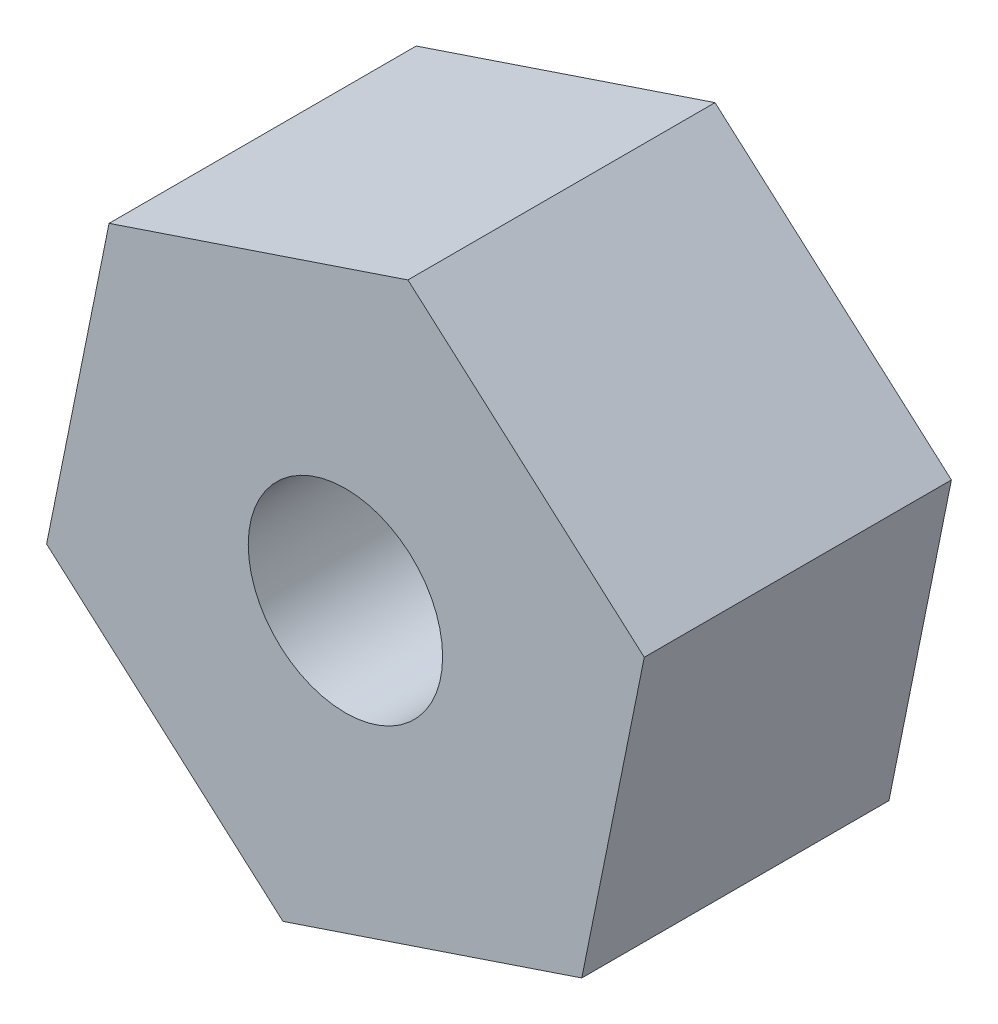
ISO-10303-21;
HEADER;
FILE_DESCRIPTION(('STEP AP214'),'2;1');
FILE_NAME('part.step','',(''),(''),'','','');
FILE_SCHEMA(('AUTOMOTIVE_DESIGN { 1 0 10303 214 1 1 1 1 }'));
ENDSEC;
DATA;
#1=APPLICATION_CONTEXT('core data for automotive mechanical design processes');
#2=APPLICATION_PROTOCOL_DEFINITION('international standard','automotive_design',2000,#1);
#3=PRODUCT_CONTEXT('',#1,'mechanical');
#4=PRODUCT('Part','Part','',(#3));
#5=PRODUCT_RELATED_PRODUCT_CATEGORY('part','',(#4));
#6=PRODUCT_DEFINITION_FORMATION('','',#4);
#7=PRODUCT_DEFINITION_CONTEXT('part definition',#1,'design');
#8=PRODUCT_DEFINITION('design','',#6,#7);
#9=PRODUCT_DEFINITION_SHAPE('','',#8);
#10=(LENGTH_UNIT() NAMED_UNIT(*) SI_UNIT(.MILLI.,.METRE.));
#11=(NAMED_UNIT(*) PLANE_ANGLE_UNIT() SI_UNIT($,.RADIAN.));
#12=(NAMED_UNIT(*) SI_UNIT($,.STERADIAN.) SOLID_ANGLE_UNIT());
#13=UNCERTAINTY_MEASURE_WITH_UNIT(LENGTH_MEASURE(1.E-05),#10,'distance_accuracy_value','');
#14=(GEOMETRIC_REPRESENTATION_CONTEXT(3) GLOBAL_UNCERTAINTY_ASSIGNED_CONTEXT((#13)) GLOBAL_UNIT_ASSIGNED_CONTEXT((#10,
#11,#12)) REPRESENTATION_CONTEXT('',''));
#15=CARTESIAN_POINT('',(0.,0.,0.));
#16=DIRECTION('',(0.,0.,1.));
#17=DIRECTION('',(1.,0.,0.));
#18=AXIS2_PLACEMENT_3D('',#15,#16,#17);
#19=CARTESIAN_POINT('',(3.4752921012422,1.16755220199215,3.571875));
#20=DIRECTION('',(0.,0.,1.));
#21=DIRECTION('',(1.,0.,0.));
#22=AXIS2_PLACEMENT_3D('',#19,#20,#21);
#23=PLANE('',#22);
#24=DIRECTION('',(0.198167392481722,0.980168191973702,0.));
#25=VECTOR('',#24,1.);
#26=CARTESIAN_POINT('',(2.74877591779076,-2.42591514425107,3.571875));
#27=LINE('',#26,#25);
#28=CARTESIAN_POINT('',(2.74877591779076,-2.42591514425107,3.571875));
#29=VERTEX_POINT('',#28);
#30=CARTESIAN_POINT('',(3.4752921012422,1.16755220199215,3.571875));
#31=VERTEX_POINT('',#30);
#32=EDGE_CURVE('E130',#29,#31,#27,.T.);
#33=ORIENTED_EDGE('',*,*,#32,.T.);
#34=DIRECTION('',(-0.749766857989827,0.661702092077743,0.));
#35=VECTOR('',#34,1.);
#36=CARTESIAN_POINT('',(3.4752921012422,1.16755220199215,3.571875));
#37=LINE('',#36,#35);
#38=CARTESIAN_POINT('',(0.72651618345144,3.59346734624322,3.571875));
#39=VERTEX_POINT('',#38);
#40=EDGE_CURVE('E88',#31,#39,#37,.T.);
#41=ORIENTED_EDGE('',*,*,#40,.T.);
#42=DIRECTION('',(-0.947934250471549,-0.318466099895958,0.));
#43=VECTOR('',#42,1.);
#44=CARTESIAN_POINT('',(0.72651618345144,3.59346734624322,3.571875));
#45=LINE('',#44,#43);
#46=CARTESIAN_POINT('',(-2.74877591779076,2.42591514425107,3.571875));
#47=VERTEX_POINT('',#46);
#48=EDGE_CURVE('E101',#39,#47,#45,.T.);
#49=ORIENTED_EDGE('',*,*,#48,.T.);
#50=DIRECTION('',(-0.198167392481722,-0.980168191973702,0.));
#51=VECTOR('',#50,1.);
#52=CARTESIAN_POINT('',(-2.74877591779076,2.42591514425107,3.571875));
#53=LINE('',#52,#51);
#54=CARTESIAN_POINT('',(-3.4752921012422,-1.16755220199215,3.571875));
#55=VERTEX_POINT('',#54);
#56=EDGE_CURVE('E95',#47,#55,#53,.T.);
#57=ORIENTED_EDGE('',*,*,#56,.T.);
#58=DIRECTION('',(0.749766857989828,-0.661702092077742,0.));
#59=VECTOR('',#58,1.);
#60=CARTESIAN_POINT('',(-3.4752921012422,-1.16755220199215,3.571875));
#61=LINE('',#60,#59);
#62=CARTESIAN_POINT('',(-0.726516183451439,-3.59346734624322,3.571875));
#63=VERTEX_POINT('',#62);
#64=EDGE_CURVE('E99',#55,#63,#61,.T.);
#65=ORIENTED_EDGE('',*,*,#64,.T.);
#66=DIRECTION('',(0.947934250471549,0.318466099895958,0.));
#67=VECTOR('',#66,1.);
#68=CARTESIAN_POINT('',(-0.726516183451439,-3.59346734624322,3.571875));
#69=LINE('',#68,#67);
#70=EDGE_CURVE('E51',#63,#29,#69,.T.);
#71=ORIENTED_EDGE('',*,*,#70,.T.);
#72=EDGE_LOOP('',(#33,#41,#49,#57,#65,#71));
#73=FACE_BOUND('',#72,.T.);
#74=CARTESIAN_POINT('',(0.,0.,3.571875));
#75=DIRECTION('',(0.,0.,1.));
#76=DIRECTION('',(1.,0.,0.));
#77=AXIS2_PLACEMENT_3D('',#74,#75,#76);
#78=CIRCLE('',#77,1.1303);
#79=CARTESIAN_POINT('',(1.1303,0.,3.571875));
#80=VERTEX_POINT('',#79);
#81=EDGE_CURVE('E123',#80,#80,#78,.T.);
#82=ORIENTED_EDGE('',*,*,#81,.F.);
#83=EDGE_LOOP('',(#82));
#84=FACE_BOUND('',#83,.T.);
#85=ADVANCED_FACE('F34',(#73,#84),#23,.T.);
#86=CARTESIAN_POINT('',(3.4752921012422,1.16755220199215,0.));
#87=DIRECTION('',(0.,0.,1.));
#88=DIRECTION('',(1.,0.,0.));
#89=AXIS2_PLACEMENT_3D('',#86,#87,#88);
#90=PLANE('',#89);
#91=DIRECTION('',(0.198167392481722,0.980168191973702,0.));
#92=VECTOR('',#91,1.);
#93=CARTESIAN_POINT('',(2.74877591779076,-2.42591514425107,0.));
#94=LINE('',#93,#92);
#95=CARTESIAN_POINT('',(2.74877591779076,-2.42591514425107,0.));
#96=VERTEX_POINT('',#95);
#97=CARTESIAN_POINT('',(3.4752921012422,1.16755220199215,0.));
#98=VERTEX_POINT('',#97);
#99=EDGE_CURVE('E119',#96,#98,#94,.T.);
#100=ORIENTED_EDGE('',*,*,#99,.F.);
#101=DIRECTION('',(0.947934250471549,0.318466099895958,0.));
#102=VECTOR('',#101,1.);
#103=CARTESIAN_POINT('',(-0.726516183451439,-3.59346734624322,0.));
#104=LINE('',#103,#102);
#105=CARTESIAN_POINT('',(-0.726516183451439,-3.59346734624322,0.));
#106=VERTEX_POINT('',#105);
#107=EDGE_CURVE('E80',#106,#96,#104,.T.);
#108=ORIENTED_EDGE('',*,*,#107,.F.);
#109=DIRECTION('',(0.749766857989828,-0.661702092077742,0.));
#110=VECTOR('',#109,1.);
#111=CARTESIAN_POINT('',(-3.4752921012422,-1.16755220199215,0.));
#112=LINE('',#111,#110);
#113=CARTESIAN_POINT('',(-3.4752921012422,-1.16755220199215,0.));
#114=VERTEX_POINT('',#113);
#115=EDGE_CURVE('E74',#114,#106,#112,.T.);
#116=ORIENTED_EDGE('',*,*,#115,.F.);
#117=DIRECTION('',(-0.198167392481722,-0.980168191973702,0.));
#118=VECTOR('',#117,1.);
#119=CARTESIAN_POINT('',(-2.74877591779076,2.42591514425107,0.));
#120=LINE('',#119,#118);
#121=CARTESIAN_POINT('',(-2.74877591779076,2.42591514425107,0.));
#122=VERTEX_POINT('',#121);
#123=EDGE_CURVE('E109',#122,#114,#120,.T.);
#124=ORIENTED_EDGE('',*,*,#123,.F.);
#125=DIRECTION('',(-0.947934250471549,-0.318466099895958,0.));
#126=VECTOR('',#125,1.);
#127=CARTESIAN_POINT('',(0.72651618345144,3.59346734624322,0.));
#128=LINE('',#127,#126);
#129=CARTESIAN_POINT('',(0.72651618345144,3.59346734624322,0.));
#130=VERTEX_POINT('',#129);
#131=EDGE_CURVE('E125',#130,#122,#128,.T.);
#132=ORIENTED_EDGE('',*,*,#131,.F.);
#133=DIRECTION('',(-0.749766857989827,0.661702092077743,0.));
#134=VECTOR('',#133,1.);
#135=CARTESIAN_POINT('',(3.4752921012422,1.16755220199215,0.));
#136=LINE('',#135,#134);
#137=EDGE_CURVE('E122',#98,#130,#136,.T.);
#138=ORIENTED_EDGE('',*,*,#137,.F.);
#139=EDGE_LOOP('',(#100,#108,#116,#124,#132,#138));
#140=FACE_BOUND('',#139,.T.);
#141=CARTESIAN_POINT('',(0.,0.,0.));
#142=DIRECTION('',(0.,0.,1.));
#143=DIRECTION('',(1.,0.,0.));
#144=AXIS2_PLACEMENT_3D('',#141,#142,#143);
#145=CIRCLE('',#144,1.1303);
#146=CARTESIAN_POINT('',(1.1303,0.,0.));
#147=VERTEX_POINT('',#146);
#148=EDGE_CURVE('E223',#147,#147,#145,.T.);
#149=ORIENTED_EDGE('',*,*,#148,.T.);
#150=EDGE_LOOP('',(#149));
#151=FACE_BOUND('',#150,.T.);
#152=ADVANCED_FACE('F139',(#140,#151),#90,.F.);
#153=CARTESIAN_POINT('',(2.74877591779076,-2.42591514425107,3.571875));
#154=DIRECTION('',(-0.980168191973702,0.198167392481722,0.));
#155=DIRECTION('',(-0.198167392481722,-0.980168191973702,0.));
#156=AXIS2_PLACEMENT_3D('',#153,#154,#155);
#157=PLANE('',#156);
#158=ORIENTED_EDGE('',*,*,#99,.T.);
#159=DIRECTION('',(0.,0.,-1.));
#160=VECTOR('',#159,1.);
#161=CARTESIAN_POINT('',(3.4752921012422,1.16755220199215,3.571875));
#162=LINE('',#161,#160);
#163=EDGE_CURVE('E11',#31,#98,#162,.T.);
#164=ORIENTED_EDGE('',*,*,#163,.F.);
#165=ORIENTED_EDGE('',*,*,#32,.F.);
#166=DIRECTION('',(0.,0.,-1.));
#167=VECTOR('',#166,1.);
#168=CARTESIAN_POINT('',(2.74877591779076,-2.42591514425107,3.571875));
#169=LINE('',#168,#167);
#170=EDGE_CURVE('E115',#29,#96,#169,.T.);
#171=ORIENTED_EDGE('',*,*,#170,.T.);
#172=EDGE_LOOP('',(#158,#164,#165,#171));
#173=FACE_BOUND('',#172,.T.);
#174=ADVANCED_FACE('F36',(#173),#157,.F.);
#175=CARTESIAN_POINT('',(3.4752921012422,1.16755220199215,3.571875));
#176=DIRECTION('',(-0.661702092077744,-0.749766857989827,0.));
#177=DIRECTION('',(0.749766857989827,-0.661702092077744,0.));
#178=AXIS2_PLACEMENT_3D('',#175,#176,#177);
#179=PLANE('',#178);
#180=ORIENTED_EDGE('',*,*,#137,.T.);
#181=DIRECTION('',(0.,0.,-1.));
#182=VECTOR('',#181,1.);
#183=CARTESIAN_POINT('',(0.72651618345144,3.59346734624322,3.571875));
#184=LINE('',#183,#182);
#185=EDGE_CURVE('E43',#39,#130,#184,.T.);
#186=ORIENTED_EDGE('',*,*,#185,.F.);
#187=ORIENTED_EDGE('',*,*,#40,.F.);
#188=ORIENTED_EDGE('',*,*,#163,.T.);
#189=EDGE_LOOP('',(#180,#186,#187,#188));
#190=FACE_BOUND('',#189,.T.);
#191=ADVANCED_FACE('F164',(#190),#179,.F.);
#192=CARTESIAN_POINT('',(0.72651618345144,3.59346734624322,3.571875));
#193=DIRECTION('',(0.318466099895958,-0.947934250471549,0.));
#194=DIRECTION('',(0.947934250471549,0.318466099895958,0.));
#195=AXIS2_PLACEMENT_3D('',#192,#193,#194);
#196=PLANE('',#195);
#197=ORIENTED_EDGE('',*,*,#131,.T.);
#198=DIRECTION('',(0.,0.,-1.));
#199=VECTOR('',#198,1.);
#200=CARTESIAN_POINT('',(-2.74877591779076,2.42591514425107,3.571875));
#201=LINE('',#200,#199);
#202=EDGE_CURVE('E110',#47,#122,#201,.T.);
#203=ORIENTED_EDGE('',*,*,#202,.F.);
#204=ORIENTED_EDGE('',*,*,#48,.F.);
#205=ORIENTED_EDGE('',*,*,#185,.T.);
#206=EDGE_LOOP('',(#197,#203,#204,#205));
#207=FACE_BOUND('',#206,.T.);
#208=ADVANCED_FACE('F136',(#207),#196,.F.);
#209=CARTESIAN_POINT('',(-2.74877591779076,2.42591514425107,3.571875));
#210=DIRECTION('',(0.980168191973702,-0.198167392481722,0.));
#211=DIRECTION('',(0.198167392481722,0.980168191973702,0.));
#212=AXIS2_PLACEMENT_3D('',#209,#210,#211);
#213=PLANE('',#212);
#214=ORIENTED_EDGE('',*,*,#123,.T.);
#215=DIRECTION('',(0.,0.,-1.));
#216=VECTOR('',#215,1.);
#217=CARTESIAN_POINT('',(-3.4752921012422,-1.16755220199215,3.571875));
#218=LINE('',#217,#216);
#219=EDGE_CURVE('E106',#55,#114,#218,.T.);
#220=ORIENTED_EDGE('',*,*,#219,.F.);
#221=ORIENTED_EDGE('',*,*,#56,.F.);
#222=ORIENTED_EDGE('',*,*,#202,.T.);
#223=EDGE_LOOP('',(#214,#220,#221,#222));
#224=FACE_BOUND('',#223,.T.);
#225=ADVANCED_FACE('F107',(#224),#213,.F.);
#226=CARTESIAN_POINT('',(-3.4752921012422,-1.16755220199215,3.571875));
#227=DIRECTION('',(0.661702092077742,0.749766857989828,0.));
#228=DIRECTION('',(-0.749766857989828,0.661702092077742,0.));
#229=AXIS2_PLACEMENT_3D('',#226,#227,#228);
#230=PLANE('',#229);
#231=ORIENTED_EDGE('',*,*,#115,.T.);
#232=DIRECTION('',(0.,0.,-1.));
#233=VECTOR('',#232,1.);
#234=CARTESIAN_POINT('',(-0.726516183451439,-3.59346734624322,3.571875));
#235=LINE('',#234,#233);
#236=EDGE_CURVE('E111',#63,#106,#235,.T.);
#237=ORIENTED_EDGE('',*,*,#236,.F.);
#238=ORIENTED_EDGE('',*,*,#64,.F.);
#239=ORIENTED_EDGE('',*,*,#219,.T.);
#240=EDGE_LOOP('',(#231,#237,#238,#239));
#241=FACE_BOUND('',#240,.T.);
#242=ADVANCED_FACE('F113',(#241),#230,.F.);
#243=CARTESIAN_POINT('',(-0.726516183451439,-3.59346734624322,3.571875));
#244=DIRECTION('',(-0.318466099895958,0.947934250471549,0.));
#245=DIRECTION('',(-0.947934250471549,-0.318466099895958,0.));
#246=AXIS2_PLACEMENT_3D('',#243,#244,#245);
#247=PLANE('',#246);
#248=ORIENTED_EDGE('',*,*,#107,.T.);
#249=ORIENTED_EDGE('',*,*,#170,.F.);
#250=ORIENTED_EDGE('',*,*,#70,.F.);
#251=ORIENTED_EDGE('',*,*,#236,.T.);
#252=EDGE_LOOP('',(#248,#249,#250,#251));
#253=FACE_BOUND('',#252,.T.);
#254=ADVANCED_FACE('F144',(#253),#247,.F.);
#255=CARTESIAN_POINT('',(0.,0.,3.571875));
#256=DIRECTION('',(0.,0.,-1.));
#257=DIRECTION('',(-1.,0.,0.));
#258=AXIS2_PLACEMENT_3D('',#255,#256,#257);
#259=CYLINDRICAL_SURFACE('',#258,1.1303);
#260=ORIENTED_EDGE('',*,*,#81,.T.);
#261=EDGE_LOOP('',(#260));
#262=FACE_BOUND('',#261,.T.);
#263=ORIENTED_EDGE('',*,*,#148,.F.);
#264=EDGE_LOOP('',(#263));
#265=FACE_BOUND('',#264,.T.);
#266=ADVANCED_FACE('F146',(#262,#265),#259,.F.);
#267=CLOSED_SHELL('',(#85,#152,#174,#191,#208,#225,#242,#254,#266));
#268=MANIFOLD_SOLID_BREP('B2',#267);
#269=ADVANCED_BREP_SHAPE_REPRESENTATION('',(#18,#268),#14);
#270=SHAPE_DEFINITION_REPRESENTATION(#9,#269);
ENDSEC;
END-ISO-10303-21;
